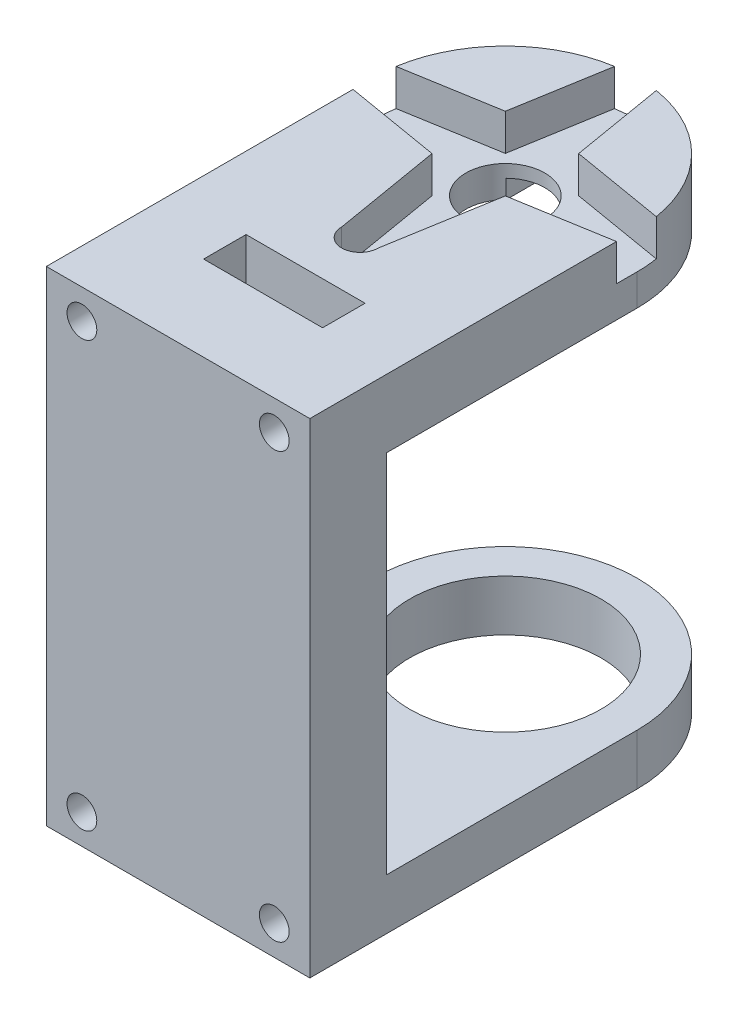
ISO-10303-21;
HEADER;
FILE_DESCRIPTION(('STEP AP214'),'2;1');
FILE_NAME('part.step','',(''),(''),'','','');
FILE_SCHEMA(('AUTOMOTIVE_DESIGN { 1 0 10303 214 1 1 1 1 }'));
ENDSEC;
DATA;
#1=APPLICATION_CONTEXT('core data for automotive mechanical design processes');
#2=APPLICATION_PROTOCOL_DEFINITION('international standard','automotive_design',2000,#1);
#3=PRODUCT_CONTEXT('',#1,'mechanical');
#4=PRODUCT('Part','Part','',(#3));
#5=PRODUCT_RELATED_PRODUCT_CATEGORY('part','',(#4));
#6=PRODUCT_DEFINITION_FORMATION('','',#4);
#7=PRODUCT_DEFINITION_CONTEXT('part definition',#1,'design');
#8=PRODUCT_DEFINITION('design','',#6,#7);
#9=PRODUCT_DEFINITION_SHAPE('','',#8);
#10=(LENGTH_UNIT() NAMED_UNIT(*) SI_UNIT(.MILLI.,.METRE.));
#11=(NAMED_UNIT(*) PLANE_ANGLE_UNIT() SI_UNIT($,.RADIAN.));
#12=(NAMED_UNIT(*) SI_UNIT($,.STERADIAN.) SOLID_ANGLE_UNIT());
#13=UNCERTAINTY_MEASURE_WITH_UNIT(LENGTH_MEASURE(1.E-05),#10,'distance_accuracy_value','');
#14=(GEOMETRIC_REPRESENTATION_CONTEXT(3) GLOBAL_UNCERTAINTY_ASSIGNED_CONTEXT((#13)) GLOBAL_UNIT_ASSIGNED_CONTEXT((#10,
#11,#12)) REPRESENTATION_CONTEXT('',''));
#15=CARTESIAN_POINT('',(0.,0.,0.));
#16=DIRECTION('',(0.,0.,1.));
#17=DIRECTION('',(1.,0.,0.));
#18=AXIS2_PLACEMENT_3D('',#15,#16,#17);
#19=CARTESIAN_POINT('',(15.5,20.5,-45.));
#20=DIRECTION('',(0.,1.,0.));
#21=DIRECTION('',(0.,0.,1.));
#22=AXIS2_PLACEMENT_3D('',#19,#20,#21);
#23=PLANE('',#22);
#24=DIRECTION('',(-1.,0.,0.));
#25=VECTOR('',#24,1.);
#26=CARTESIAN_POINT('',(15.5,20.5,-6.00000000000001));
#27=LINE('',#26,#25);
#28=CARTESIAN_POINT('',(7.,20.5,-6.));
#29=VERTEX_POINT('',#28);
#30=CARTESIAN_POINT('',(-7.,20.5,-6.));
#31=VERTEX_POINT('',#30);
#32=EDGE_CURVE('E266',#29,#31,#27,.T.);
#33=ORIENTED_EDGE('',*,*,#32,.T.);
#34=DIRECTION('',(0.,0.,1.));
#35=VECTOR('',#34,1.);
#36=CARTESIAN_POINT('',(-6.99999999999999,20.5,-45.));
#37=LINE('',#36,#35);
#38=CARTESIAN_POINT('',(-7.,20.5,-1.));
#39=VERTEX_POINT('',#38);
#40=EDGE_CURVE('E269',#31,#39,#37,.T.);
#41=ORIENTED_EDGE('',*,*,#40,.T.);
#42=DIRECTION('',(1.,0.,0.));
#43=VECTOR('',#42,1.);
#44=CARTESIAN_POINT('',(15.5,20.5,-1.));
#45=LINE('',#44,#43);
#46=CARTESIAN_POINT('',(7.,20.5,-1.));
#47=VERTEX_POINT('',#46);
#48=EDGE_CURVE('E261',#39,#47,#45,.T.);
#49=ORIENTED_EDGE('',*,*,#48,.T.);
#50=DIRECTION('',(0.,0.,-1.));
#51=VECTOR('',#50,1.);
#52=CARTESIAN_POINT('',(7.,20.5,-45.));
#53=LINE('',#52,#51);
#54=EDGE_CURVE('E241',#47,#29,#53,.T.);
#55=ORIENTED_EDGE('',*,*,#54,.T.);
#56=EDGE_LOOP('',(#33,#41,#49,#55));
#57=FACE_BOUND('',#56,.T.);
#58=DIRECTION('',(0.,0.,-1.));
#59=VECTOR('',#58,1.);
#60=CARTESIAN_POINT('',(-3.25,20.5,0.));
#61=LINE('',#60,#59);
#62=CARTESIAN_POINT('',(-3.25,20.5,-32.8256578296632));
#63=VERTEX_POINT('',#62);
#64=CARTESIAN_POINT('',(-3.25,20.5,-44.6554445662277));
#65=VERTEX_POINT('',#64);
#66=EDGE_CURVE('E277',#63,#65,#61,.T.);
#67=ORIENTED_EDGE('',*,*,#66,.F.);
#68=CARTESIAN_POINT('',(0.,20.5,-29.5));
#69=DIRECTION('',(0.,-1.,0.));
#70=DIRECTION('',(0.,0.,-1.));
#71=AXIS2_PLACEMENT_3D('',#68,#69,#70);
#72=CIRCLE('',#71,4.65);
#73=CARTESIAN_POINT('',(3.25,20.5,-32.8256578296632));
#74=VERTEX_POINT('',#73);
#75=EDGE_CURVE('E272',#74,#63,#72,.T.);
#76=ORIENTED_EDGE('',*,*,#75,.F.);
#77=DIRECTION('',(0.,0.,-1.));
#78=VECTOR('',#77,1.);
#79=CARTESIAN_POINT('',(3.24999999999999,20.5,0.));
#80=LINE('',#79,#78);
#81=CARTESIAN_POINT('',(3.25000000000001,20.5,-44.6554445662277));
#82=VERTEX_POINT('',#81);
#83=EDGE_CURVE('E281',#74,#82,#80,.T.);
#84=ORIENTED_EDGE('',*,*,#83,.T.);
#85=CARTESIAN_POINT('',(0.,20.5,-29.5));
#86=DIRECTION('',(0.,1.,0.));
#87=DIRECTION('',(0.,0.,1.));
#88=AXIS2_PLACEMENT_3D('',#85,#86,#87);
#89=CIRCLE('',#88,15.5);
#90=CARTESIAN_POINT('',(15.5,20.5,-29.5));
#91=VERTEX_POINT('',#90);
#92=EDGE_CURVE('E385',#82,#91,#89,.F.);
#93=ORIENTED_EDGE('',*,*,#92,.T.);
#94=DIRECTION('',(0.,0.,1.));
#95=VECTOR('',#94,1.);
#96=CARTESIAN_POINT('',(15.5,20.5,-45.));
#97=LINE('',#96,#95);
#98=CARTESIAN_POINT('',(15.5,20.5,0.));
#99=VERTEX_POINT('',#98);
#100=EDGE_CURVE('E401',#91,#99,#97,.T.);
#101=ORIENTED_EDGE('',*,*,#100,.T.);
#102=DIRECTION('',(-1.,0.,0.));
#103=VECTOR('',#102,1.);
#104=CARTESIAN_POINT('',(15.5,20.5,0.));
#105=LINE('',#104,#103);
#106=CARTESIAN_POINT('',(-15.5,20.5,0.));
#107=VERTEX_POINT('',#106);
#108=EDGE_CURVE('E396',#99,#107,#105,.T.);
#109=ORIENTED_EDGE('',*,*,#108,.T.);
#110=DIRECTION('',(0.,0.,1.));
#111=VECTOR('',#110,1.);
#112=CARTESIAN_POINT('',(-15.5,20.5,-45.));
#113=LINE('',#112,#111);
#114=CARTESIAN_POINT('',(-15.5,20.5,-29.5));
#115=VERTEX_POINT('',#114);
#116=EDGE_CURVE('E399',#115,#107,#113,.T.);
#117=ORIENTED_EDGE('',*,*,#116,.F.);
#118=EDGE_CURVE('E386',#115,#65,#89,.F.);
#119=ORIENTED_EDGE('',*,*,#118,.T.);
#120=EDGE_LOOP('',(#67,#76,#84,#93,#101,#109,#117,#119));
#121=FACE_BOUND('',#120,.T.);
#122=ADVANCED_FACE('F50',(#57,#121),#23,.F.);
#123=CARTESIAN_POINT('',(0.,28.5,-29.5));
#124=DIRECTION('',(0.,-1.,0.));
#125=DIRECTION('',(0.,0.,-1.));
#126=AXIS2_PLACEMENT_3D('',#123,#124,#125);
#127=CYLINDRICAL_SURFACE('',#126,15.5);
#128=DIRECTION('',(0.,-1.,0.));
#129=VECTOR('',#128,1.);
#130=CARTESIAN_POINT('',(3.25000000000001,22.7,-44.6554445662277));
#131=LINE('',#130,#129);
#132=CARTESIAN_POINT('',(3.25000000000001,22.7,-44.6554445662277));
#133=VERTEX_POINT('',#132);
#134=EDGE_CURVE('E295',#133,#82,#131,.T.);
#135=ORIENTED_EDGE('',*,*,#134,.F.);
#136=CARTESIAN_POINT('',(0.,22.7,-29.5));
#137=DIRECTION('',(0.,-1.,0.));
#138=DIRECTION('',(0.,0.,-1.));
#139=AXIS2_PLACEMENT_3D('',#136,#137,#138);
#140=CIRCLE('',#139,15.5);
#141=CARTESIAN_POINT('',(-3.25,22.7,-44.6554445662277));
#142=VERTEX_POINT('',#141);
#143=EDGE_CURVE('E283',#142,#133,#140,.T.);
#144=ORIENTED_EDGE('',*,*,#143,.F.);
#145=DIRECTION('',(0.,-1.,0.));
#146=VECTOR('',#145,1.);
#147=CARTESIAN_POINT('',(-3.25,22.7,-44.6554445662277));
#148=LINE('',#147,#146);
#149=EDGE_CURVE('E297',#142,#65,#148,.T.);
#150=ORIENTED_EDGE('',*,*,#149,.T.);
#151=ORIENTED_EDGE('',*,*,#118,.F.);
#152=DIRECTION('',(0.,-1.,0.));
#153=VECTOR('',#152,1.);
#154=CARTESIAN_POINT('',(-15.5,28.5,-29.5));
#155=LINE('',#154,#153);
#156=CARTESIAN_POINT('',(-15.5,24.2,-29.5));
#157=VERTEX_POINT('',#156);
#158=EDGE_CURVE('E371',#157,#115,#155,.T.);
#159=ORIENTED_EDGE('',*,*,#158,.F.);
#160=CARTESIAN_POINT('',(0.,24.2,-29.5));
#161=DIRECTION('',(0.,1.,0.));
#162=DIRECTION('',(0.,0.,1.));
#163=AXIS2_PLACEMENT_3D('',#160,#161,#162);
#164=CIRCLE('',#163,15.5);
#165=CARTESIAN_POINT('',(-15.3045421529556,24.2,-31.953770463675));
#166=VERTEX_POINT('',#165);
#167=EDGE_CURVE('E429',#166,#157,#164,.T.);
#168=ORIENTED_EDGE('',*,*,#167,.F.);
#169=DIRECTION('',(0.,-1.,0.));
#170=VECTOR('',#169,1.);
#171=CARTESIAN_POINT('',(-15.3045421529556,28.5,-31.953770463675));
#172=LINE('',#171,#170);
#173=CARTESIAN_POINT('',(-15.3045421529556,28.5,-31.953770463675));
#174=VERTEX_POINT('',#173);
#175=EDGE_CURVE('E431',#166,#174,#172,.F.);
#176=ORIENTED_EDGE('',*,*,#175,.T.);
#177=CARTESIAN_POINT('',(0.,28.5,-29.5));
#178=DIRECTION('',(0.,-1.,0.));
#179=DIRECTION('',(0.,0.,-1.));
#180=AXIS2_PLACEMENT_3D('',#177,#178,#179);
#181=CIRCLE('',#180,15.5);
#182=CARTESIAN_POINT('',(-2.45377046367497,28.5,-44.8045421529556));
#183=VERTEX_POINT('',#182);
#184=EDGE_CURVE('E374',#183,#174,#181,.F.);
#185=ORIENTED_EDGE('',*,*,#184,.F.);
#186=DIRECTION('',(0.,-1.,0.));
#187=VECTOR('',#186,1.);
#188=CARTESIAN_POINT('',(-2.45377046367497,28.5,-44.8045421529556));
#189=LINE('',#188,#187);
#190=CARTESIAN_POINT('',(-2.45377046367497,24.2,-44.8045421529556));
#191=VERTEX_POINT('',#190);
#192=EDGE_CURVE('E439',#183,#191,#189,.T.);
#193=ORIENTED_EDGE('',*,*,#192,.T.);
#194=CARTESIAN_POINT('',(2.45377046367497,24.2,-44.8045421529556));
#195=VERTEX_POINT('',#194);
#196=EDGE_CURVE('E433',#195,#191,#164,.T.);
#197=ORIENTED_EDGE('',*,*,#196,.F.);
#198=DIRECTION('',(0.,-1.,0.));
#199=VECTOR('',#198,1.);
#200=CARTESIAN_POINT('',(2.45377046367497,28.5,-44.8045421529556));
#201=LINE('',#200,#199);
#202=CARTESIAN_POINT('',(2.45377046367497,28.5,-44.8045421529556));
#203=VERTEX_POINT('',#202);
#204=EDGE_CURVE('E436',#195,#203,#201,.F.);
#205=ORIENTED_EDGE('',*,*,#204,.T.);
#206=CARTESIAN_POINT('',(15.3045421529557,28.5,-31.953770463675));
#207=VERTEX_POINT('',#206);
#208=EDGE_CURVE('E377',#207,#203,#181,.F.);
#209=ORIENTED_EDGE('',*,*,#208,.F.);
#210=DIRECTION('',(0.,-1.,0.));
#211=VECTOR('',#210,1.);
#212=CARTESIAN_POINT('',(15.3045421529556,28.5,-31.953770463675));
#213=LINE('',#212,#211);
#214=CARTESIAN_POINT('',(15.3045421529557,24.2,-31.953770463675));
#215=VERTEX_POINT('',#214);
#216=EDGE_CURVE('E442',#207,#215,#213,.T.);
#217=ORIENTED_EDGE('',*,*,#216,.T.);
#218=CARTESIAN_POINT('',(15.5,24.2,-29.5));
#219=VERTEX_POINT('',#218);
#220=EDGE_CURVE('E432',#219,#215,#164,.T.);
#221=ORIENTED_EDGE('',*,*,#220,.F.);
#222=DIRECTION('',(0.,-1.,0.));
#223=VECTOR('',#222,1.);
#224=CARTESIAN_POINT('',(15.5,28.5,-29.5));
#225=LINE('',#224,#223);
#226=EDGE_CURVE('E379',#219,#91,#225,.T.);
#227=ORIENTED_EDGE('',*,*,#226,.T.);
#228=ORIENTED_EDGE('',*,*,#92,.F.);
#229=EDGE_LOOP('',(#135,#144,#150,#151,#159,#168,#176,#185,#193,#197,#205,#209,#217,#221,#227,#228));
#230=FACE_BOUND('',#229,.T.);
#231=ADVANCED_FACE('F493',(#230),#127,.T.);
#232=CARTESIAN_POINT('',(15.5,28.5,9.));
#233=DIRECTION('',(0.,-1.,0.));
#234=DIRECTION('',(0.,0.,-1.));
#235=AXIS2_PLACEMENT_3D('',#232,#233,#234);
#236=PLANE('',#235);
#237=ORIENTED_EDGE('',*,*,#184,.T.);
#238=DIRECTION('',(-0.985987773459867,0.,0.16681759675662));
#239=VECTOR('',#238,1.);
#240=CARTESIAN_POINT('',(-17.1,28.5,-31.65));
#241=LINE('',#240,#239);
#242=CARTESIAN_POINT('',(-4.31335136523794,28.5,-33.8133513652379));
#243=VERTEX_POINT('',#242);
#244=EDGE_CURVE('E305',#243,#174,#241,.T.);
#245=ORIENTED_EDGE('',*,*,#244,.F.);
#246=DIRECTION('',(-0.16681759675662,0.,0.985987773459867));
#247=VECTOR('',#246,1.);
#248=CARTESIAN_POINT('',(-4.31335136523794,28.5,-33.8133513652379));
#249=LINE('',#248,#247);
#250=EDGE_CURVE('E343',#183,#243,#249,.T.);
#251=ORIENTED_EDGE('',*,*,#250,.F.);
#252=EDGE_LOOP('',(#237,#245,#251));
#253=FACE_BOUND('',#252,.T.);
#254=ADVANCED_FACE('F511',(#253),#236,.F.);
#255=ORIENTED_EDGE('',*,*,#208,.T.);
#256=DIRECTION('',(-0.16681759675662,0.,-0.985987773459867));
#257=VECTOR('',#256,1.);
#258=CARTESIAN_POINT('',(4.31335136523794,28.5,-33.8133513652379));
#259=LINE('',#258,#257);
#260=CARTESIAN_POINT('',(4.31335136523794,28.5,-33.8133513652379));
#261=VERTEX_POINT('',#260);
#262=EDGE_CURVE('E341',#261,#203,#259,.T.);
#263=ORIENTED_EDGE('',*,*,#262,.F.);
#264=DIRECTION('',(-0.985987773459867,0.,-0.16681759675662));
#265=VECTOR('',#264,1.);
#266=CARTESIAN_POINT('',(17.1,28.5,-31.65));
#267=LINE('',#266,#265);
#268=EDGE_CURVE('E339',#207,#261,#267,.T.);
#269=ORIENTED_EDGE('',*,*,#268,.F.);
#270=EDGE_LOOP('',(#255,#263,#269));
#271=FACE_BOUND('',#270,.T.);
#272=ADVANCED_FACE('F560',(#271),#236,.F.);
#273=CARTESIAN_POINT('',(15.5,-28.5,9.));
#274=DIRECTION('',(0.,1.,0.));
#275=DIRECTION('',(0.,0.,1.));
#276=AXIS2_PLACEMENT_3D('',#273,#274,#275);
#277=PLANE('',#276);
#278=CARTESIAN_POINT('',(0.,-28.5,-29.5));
#279=DIRECTION('',(0.,-1.,0.));
#280=DIRECTION('',(0.,0.,-1.));
#281=AXIS2_PLACEMENT_3D('',#278,#279,#280);
#282=CIRCLE('',#281,11.25);
#283=CARTESIAN_POINT('',(0.,-28.5,-40.75));
#284=VERTEX_POINT('',#283);
#285=EDGE_CURVE('E364',#284,#284,#282,.T.);
#286=ORIENTED_EDGE('',*,*,#285,.F.);
#287=EDGE_LOOP('',(#286));
#288=FACE_BOUND('',#287,.T.);
#289=DIRECTION('',(0.,0.,-1.));
#290=VECTOR('',#289,1.);
#291=CARTESIAN_POINT('',(-15.5,-28.5,9.));
#292=LINE('',#291,#290);
#293=CARTESIAN_POINT('',(-15.5,-28.5,9.));
#294=VERTEX_POINT('',#293);
#295=CARTESIAN_POINT('',(-15.5,-28.5,-29.5));
#296=VERTEX_POINT('',#295);
#297=EDGE_CURVE('E426',#294,#296,#292,.T.);
#298=ORIENTED_EDGE('',*,*,#297,.T.);
#299=CARTESIAN_POINT('',(0.,-28.5,-29.5));
#300=DIRECTION('',(0.,-1.,0.));
#301=DIRECTION('',(0.,0.,-1.));
#302=AXIS2_PLACEMENT_3D('',#299,#300,#301);
#303=CIRCLE('',#302,15.5);
#304=CARTESIAN_POINT('',(15.5,-28.5,-29.5));
#305=VERTEX_POINT('',#304);
#306=EDGE_CURVE('E373',#305,#296,#303,.F.);
#307=ORIENTED_EDGE('',*,*,#306,.F.);
#308=DIRECTION('',(0.,0.,-1.));
#309=VECTOR('',#308,1.);
#310=CARTESIAN_POINT('',(15.5,-28.5,9.));
#311=LINE('',#310,#309);
#312=CARTESIAN_POINT('',(15.5,-28.5,9.));
#313=VERTEX_POINT('',#312);
#314=EDGE_CURVE('E423',#313,#305,#311,.T.);
#315=ORIENTED_EDGE('',*,*,#314,.F.);
#316=DIRECTION('',(1.,0.,0.));
#317=VECTOR('',#316,1.);
#318=CARTESIAN_POINT('',(15.5,-28.5,9.));
#319=LINE('',#318,#317);
#320=EDGE_CURVE('E406',#294,#313,#319,.T.);
#321=ORIENTED_EDGE('',*,*,#320,.F.);
#322=EDGE_LOOP('',(#298,#307,#315,#321));
#323=FACE_BOUND('',#322,.T.);
#324=ADVANCED_FACE('F468',(#288,#323),#277,.F.);
#325=DIRECTION('',(1.,0.,0.));
#326=VECTOR('',#325,1.);
#327=CARTESIAN_POINT('',(7.,28.5,-1.));
#328=LINE('',#327,#326);
#329=CARTESIAN_POINT('',(-7.,28.5,-1.));
#330=VERTEX_POINT('',#329);
#331=CARTESIAN_POINT('',(7.,28.5,-1.));
#332=VERTEX_POINT('',#331);
#333=EDGE_CURVE('E247',#330,#332,#328,.T.);
#334=ORIENTED_EDGE('',*,*,#333,.F.);
#335=DIRECTION('',(0.,0.,1.));
#336=VECTOR('',#335,1.);
#337=CARTESIAN_POINT('',(-7.,28.5,-1.));
#338=LINE('',#337,#336);
#339=CARTESIAN_POINT('',(-7.,28.5,-6.));
#340=VERTEX_POINT('',#339);
#341=EDGE_CURVE('E73',#340,#330,#338,.T.);
#342=ORIENTED_EDGE('',*,*,#341,.F.);
#343=DIRECTION('',(-1.,0.,0.));
#344=VECTOR('',#343,1.);
#345=CARTESIAN_POINT('',(7.,28.5,-6.));
#346=LINE('',#345,#344);
#347=CARTESIAN_POINT('',(7.,28.5,-6.));
#348=VERTEX_POINT('',#347);
#349=EDGE_CURVE('E254',#348,#340,#346,.T.);
#350=ORIENTED_EDGE('',*,*,#349,.F.);
#351=DIRECTION('',(0.,0.,-1.));
#352=VECTOR('',#351,1.);
#353=CARTESIAN_POINT('',(7.,28.5,-1.));
#354=LINE('',#353,#352);
#355=EDGE_CURVE('E238',#332,#348,#354,.T.);
#356=ORIENTED_EDGE('',*,*,#355,.F.);
#357=EDGE_LOOP('',(#334,#342,#350,#356));
#358=FACE_BOUND('',#357,.T.);
#359=DIRECTION('',(0.,0.,-1.));
#360=VECTOR('',#359,1.);
#361=CARTESIAN_POINT('',(15.5,28.5,9.));
#362=LINE('',#361,#360);
#363=CARTESIAN_POINT('',(15.5,28.5,9.));
#364=VERTEX_POINT('',#363);
#365=CARTESIAN_POINT('',(15.5,28.5,-27.0792987174942));
#366=VERTEX_POINT('',#365);
#367=EDGE_CURVE('E420',#364,#366,#362,.T.);
#368=ORIENTED_EDGE('',*,*,#367,.T.);
#369=DIRECTION('',(0.985987773459867,0.,-0.166817596756619));
#370=VECTOR('',#369,1.);
#371=CARTESIAN_POINT('',(17.1,28.5,-27.35));
#372=LINE('',#371,#370);
#373=CARTESIAN_POINT('',(4.31335136523794,28.5,-25.1866486347621));
#374=VERTEX_POINT('',#373);
#375=EDGE_CURVE('E337',#374,#366,#372,.T.);
#376=ORIENTED_EDGE('',*,*,#375,.F.);
#377=DIRECTION('',(0.16681759675662,0.,-0.985987773459867));
#378=VECTOR('',#377,1.);
#379=CARTESIAN_POINT('',(4.31335136523794,28.5,-25.1866486347621));
#380=LINE('',#379,#378);
#381=CARTESIAN_POINT('',(2.14999999999999,28.5,-12.4));
#382=VERTEX_POINT('',#381);
#383=EDGE_CURVE('E334',#382,#374,#380,.T.);
#384=ORIENTED_EDGE('',*,*,#383,.F.);
#385=CARTESIAN_POINT('',(0.,28.5,-12.4));
#386=DIRECTION('',(0.,1.,0.));
#387=DIRECTION('',(0.,0.,1.));
#388=AXIS2_PLACEMENT_3D('',#385,#386,#387);
#389=CIRCLE('',#388,2.14999999999999);
#390=CARTESIAN_POINT('',(-2.14999999999998,28.5,-12.4));
#391=VERTEX_POINT('',#390);
#392=EDGE_CURVE('E331',#391,#382,#389,.T.);
#393=ORIENTED_EDGE('',*,*,#392,.F.);
#394=DIRECTION('',(0.16681759675662,0.,0.985987773459867));
#395=VECTOR('',#394,1.);
#396=CARTESIAN_POINT('',(-4.31335136523794,28.5,-25.1866486347621));
#397=LINE('',#396,#395);
#398=CARTESIAN_POINT('',(-4.31335136523794,28.5,-25.1866486347621));
#399=VERTEX_POINT('',#398);
#400=EDGE_CURVE('E328',#399,#391,#397,.T.);
#401=ORIENTED_EDGE('',*,*,#400,.F.);
#402=DIRECTION('',(0.985987773459867,0.,0.166817596756619));
#403=VECTOR('',#402,1.);
#404=CARTESIAN_POINT('',(-17.1,28.5,-27.35));
#405=LINE('',#404,#403);
#406=CARTESIAN_POINT('',(-15.5,28.5,-27.0792987174942));
#407=VERTEX_POINT('',#406);
#408=EDGE_CURVE('E294',#407,#399,#405,.T.);
#409=ORIENTED_EDGE('',*,*,#408,.F.);
#410=DIRECTION('',(0.,0.,-1.));
#411=VECTOR('',#410,1.);
#412=CARTESIAN_POINT('',(-15.5,28.5,9.));
#413=LINE('',#412,#411);
#414=CARTESIAN_POINT('',(-15.5,28.5,9.));
#415=VERTEX_POINT('',#414);
#416=EDGE_CURVE('E413',#415,#407,#413,.T.);
#417=ORIENTED_EDGE('',*,*,#416,.F.);
#418=DIRECTION('',(-1.,0.,0.));
#419=VECTOR('',#418,1.);
#420=CARTESIAN_POINT('',(15.5,28.5,9.));
#421=LINE('',#420,#419);
#422=EDGE_CURVE('E411',#364,#415,#421,.T.);
#423=ORIENTED_EDGE('',*,*,#422,.F.);
#424=EDGE_LOOP('',(#368,#376,#384,#393,#401,#409,#417,#423));
#425=FACE_BOUND('',#424,.T.);
#426=ADVANCED_FACE('F251',(#358,#425),#236,.F.);
#427=CARTESIAN_POINT('',(15.5,-22.5,-45.));
#428=DIRECTION('',(0.,-1.,0.));
#429=DIRECTION('',(0.,0.,-1.));
#430=AXIS2_PLACEMENT_3D('',#427,#428,#429);
#431=PLANE('',#430);
#432=CARTESIAN_POINT('',(0.,-22.5,-29.5));
#433=DIRECTION('',(0.,-1.,0.));
#434=DIRECTION('',(0.,0.,-1.));
#435=AXIS2_PLACEMENT_3D('',#432,#433,#434);
#436=CIRCLE('',#435,11.25);
#437=CARTESIAN_POINT('',(0.,-22.5,-40.75));
#438=VERTEX_POINT('',#437);
#439=EDGE_CURVE('E365',#438,#438,#436,.T.);
#440=ORIENTED_EDGE('',*,*,#439,.T.);
#441=EDGE_LOOP('',(#440));
#442=FACE_BOUND('',#441,.T.);
#443=CARTESIAN_POINT('',(0.,-22.5,-29.5));
#444=DIRECTION('',(0.,-1.,0.));
#445=DIRECTION('',(0.,0.,-1.));
#446=AXIS2_PLACEMENT_3D('',#443,#444,#445);
#447=CIRCLE('',#446,15.5);
#448=CARTESIAN_POINT('',(15.5,-22.5,-29.5));
#449=VERTEX_POINT('',#448);
#450=CARTESIAN_POINT('',(-15.5,-22.5,-29.5));
#451=VERTEX_POINT('',#450);
#452=EDGE_CURVE('E382',#449,#451,#447,.F.);
#453=ORIENTED_EDGE('',*,*,#452,.T.);
#454=DIRECTION('',(0.,0.,1.));
#455=VECTOR('',#454,1.);
#456=CARTESIAN_POINT('',(-15.5,-22.5,-45.));
#457=LINE('',#456,#455);
#458=CARTESIAN_POINT('',(-15.5,-22.5,0.));
#459=VERTEX_POINT('',#458);
#460=EDGE_CURVE('E394',#451,#459,#457,.T.);
#461=ORIENTED_EDGE('',*,*,#460,.T.);
#462=DIRECTION('',(1.,0.,0.));
#463=VECTOR('',#462,1.);
#464=CARTESIAN_POINT('',(15.5,-22.5,0.));
#465=LINE('',#464,#463);
#466=CARTESIAN_POINT('',(15.5,-22.5,0.));
#467=VERTEX_POINT('',#466);
#468=EDGE_CURVE('E389',#459,#467,#465,.T.);
#469=ORIENTED_EDGE('',*,*,#468,.T.);
#470=DIRECTION('',(0.,0.,1.));
#471=VECTOR('',#470,1.);
#472=CARTESIAN_POINT('',(15.5,-22.5,-45.));
#473=LINE('',#472,#471);
#474=EDGE_CURVE('E392',#449,#467,#473,.T.);
#475=ORIENTED_EDGE('',*,*,#474,.F.);
#476=EDGE_LOOP('',(#453,#461,#469,#475));
#477=FACE_BOUND('',#476,.T.);
#478=ADVANCED_FACE('F478',(#442,#477),#431,.F.);
#479=CARTESIAN_POINT('',(-15.5,-28.5,9.));
#480=DIRECTION('',(1.,0.,0.));
#481=DIRECTION('',(0.,0.,-1.));
#482=AXIS2_PLACEMENT_3D('',#479,#480,#481);
#483=PLANE('',#482);
#484=ORIENTED_EDGE('',*,*,#416,.T.);
#485=DIRECTION('',(0.,-1.,0.));
#486=VECTOR('',#485,1.);
#487=CARTESIAN_POINT('',(-15.5,-28.5,-27.0792987174942));
#488=LINE('',#487,#486);
#489=CARTESIAN_POINT('',(-15.5,24.2,-27.0792987174942));
#490=VERTEX_POINT('',#489);
#491=EDGE_CURVE('E12',#407,#490,#488,.T.);
#492=ORIENTED_EDGE('',*,*,#491,.T.);
#493=DIRECTION('',(0.,0.,1.));
#494=VECTOR('',#493,1.);
#495=CARTESIAN_POINT('',(-15.5,24.2,9.));
#496=LINE('',#495,#494);
#497=EDGE_CURVE('E349',#157,#490,#496,.T.);
#498=ORIENTED_EDGE('',*,*,#497,.F.);
#499=ORIENTED_EDGE('',*,*,#158,.T.);
#500=ORIENTED_EDGE('',*,*,#116,.T.);
#501=DIRECTION('',(0.,-1.,0.));
#502=VECTOR('',#501,1.);
#503=CARTESIAN_POINT('',(-15.5,-28.5,0.));
#504=LINE('',#503,#502);
#505=EDGE_CURVE('E403',#107,#459,#504,.T.);
#506=ORIENTED_EDGE('',*,*,#505,.T.);
#507=ORIENTED_EDGE('',*,*,#460,.F.);
#508=EDGE_CURVE('E368',#451,#296,#155,.T.);
#509=ORIENTED_EDGE('',*,*,#508,.T.);
#510=ORIENTED_EDGE('',*,*,#297,.F.);
#511=DIRECTION('',(0.,-1.,0.));
#512=VECTOR('',#511,1.);
#513=CARTESIAN_POINT('',(-15.5,10.3,9.));
#514=LINE('',#513,#512);
#515=EDGE_CURVE('E404',#415,#294,#514,.T.);
#516=ORIENTED_EDGE('',*,*,#515,.F.);
#517=EDGE_LOOP('',(#484,#492,#498,#499,#500,#506,#507,#509,#510,#516));
#518=FACE_BOUND('',#517,.T.);
#519=ADVANCED_FACE('F52',(#518),#483,.F.);
#520=CARTESIAN_POINT('',(0.,0.,0.));
#521=DIRECTION('',(0.,0.,1.));
#522=DIRECTION('',(1.,0.,0.));
#523=AXIS2_PLACEMENT_3D('',#520,#521,#522);
#524=PLANE('',#523);
#525=ORIENTED_EDGE('',*,*,#468,.F.);
#526=ORIENTED_EDGE('',*,*,#505,.F.);
#527=ORIENTED_EDGE('',*,*,#108,.F.);
#528=DIRECTION('',(0.,1.,0.));
#529=VECTOR('',#528,1.);
#530=CARTESIAN_POINT('',(15.5,-28.5,0.));
#531=LINE('',#530,#529);
#532=EDGE_CURVE('E407',#467,#99,#531,.T.);
#533=ORIENTED_EDGE('',*,*,#532,.F.);
#534=EDGE_LOOP('',(#525,#526,#527,#533));
#535=FACE_BOUND('',#534,.T.);
#536=ADVANCED_FACE('F481',(#535),#524,.F.);
#537=CARTESIAN_POINT('',(15.5,-28.5,9.));
#538=DIRECTION('',(-1.,0.,0.));
#539=DIRECTION('',(0.,0.,1.));
#540=AXIS2_PLACEMENT_3D('',#537,#538,#539);
#541=PLANE('',#540);
#542=DIRECTION('',(0.,0.,-1.));
#543=VECTOR('',#542,1.);
#544=CARTESIAN_POINT('',(15.5,24.2,9.));
#545=LINE('',#544,#543);
#546=CARTESIAN_POINT('',(15.5,24.2,-27.0792987174942));
#547=VERTEX_POINT('',#546);
#548=EDGE_CURVE('E362',#547,#219,#545,.T.);
#549=ORIENTED_EDGE('',*,*,#548,.F.);
#550=DIRECTION('',(0.,1.,0.));
#551=VECTOR('',#550,1.);
#552=CARTESIAN_POINT('',(15.5,-28.5,-27.0792987174942));
#553=LINE('',#552,#551);
#554=EDGE_CURVE('E58',#547,#366,#553,.T.);
#555=ORIENTED_EDGE('',*,*,#554,.T.);
#556=ORIENTED_EDGE('',*,*,#367,.F.);
#557=DIRECTION('',(0.,1.,0.));
#558=VECTOR('',#557,1.);
#559=CARTESIAN_POINT('',(15.5,-28.5,9.));
#560=LINE('',#559,#558);
#561=EDGE_CURVE('E409',#313,#364,#560,.T.);
#562=ORIENTED_EDGE('',*,*,#561,.F.);
#563=ORIENTED_EDGE('',*,*,#314,.T.);
#564=EDGE_CURVE('E383',#449,#305,#225,.T.);
#565=ORIENTED_EDGE('',*,*,#564,.F.);
#566=ORIENTED_EDGE('',*,*,#474,.T.);
#567=ORIENTED_EDGE('',*,*,#532,.T.);
#568=ORIENTED_EDGE('',*,*,#100,.F.);
#569=ORIENTED_EDGE('',*,*,#226,.F.);
#570=EDGE_LOOP('',(#549,#555,#556,#562,#563,#565,#566,#567,#568,#569));
#571=FACE_BOUND('',#570,.T.);
#572=ADVANCED_FACE('F448',(#571),#541,.F.);
#573=CARTESIAN_POINT('',(0.,0.,9.));
#574=DIRECTION('',(0.,0.,1.));
#575=DIRECTION('',(1.,0.,0.));
#576=AXIS2_PLACEMENT_3D('',#573,#574,#575);
#577=PLANE('',#576);
#578=CARTESIAN_POINT('',(-11.3164293901511,25.,9.));
#579=DIRECTION('',(0.,0.,1.));
#580=DIRECTION('',(-1.,0.,0.));
#581=AXIS2_PLACEMENT_3D('',#578,#579,#580);
#582=CIRCLE('',#581,1.75);
#583=CARTESIAN_POINT('',(-13.0664293901511,25.,9.));
#584=VERTEX_POINT('',#583);
#585=EDGE_CURVE('E665',#584,#584,#582,.T.);
#586=ORIENTED_EDGE('',*,*,#585,.F.);
#587=EDGE_LOOP('',(#586));
#588=FACE_BOUND('',#587,.T.);
#589=CARTESIAN_POINT('',(11.3164293901511,-25.,9.));
#590=DIRECTION('',(0.,0.,1.));
#591=DIRECTION('',(-1.,0.,0.));
#592=AXIS2_PLACEMENT_3D('',#589,#590,#591);
#593=CIRCLE('',#592,1.75);
#594=CARTESIAN_POINT('',(9.56642939015113,-25.,9.));
#595=VERTEX_POINT('',#594);
#596=EDGE_CURVE('E676',#595,#595,#593,.T.);
#597=ORIENTED_EDGE('',*,*,#596,.F.);
#598=EDGE_LOOP('',(#597));
#599=FACE_BOUND('',#598,.T.);
#600=CARTESIAN_POINT('',(-11.3164293901512,-25.,9.));
#601=DIRECTION('',(0.,0.,1.));
#602=DIRECTION('',(1.,0.,0.));
#603=AXIS2_PLACEMENT_3D('',#600,#601,#602);
#604=CIRCLE('',#603,1.75);
#605=CARTESIAN_POINT('',(-9.56642939015117,-25.,9.));
#606=VERTEX_POINT('',#605);
#607=EDGE_CURVE('E682',#606,#606,#604,.T.);
#608=ORIENTED_EDGE('',*,*,#607,.F.);
#609=EDGE_LOOP('',(#608));
#610=FACE_BOUND('',#609,.T.);
#611=CARTESIAN_POINT('',(11.3164293901511,25.,9.));
#612=DIRECTION('',(0.,0.,1.));
#613=DIRECTION('',(1.,0.,0.));
#614=AXIS2_PLACEMENT_3D('',#611,#612,#613);
#615=CIRCLE('',#614,1.75);
#616=CARTESIAN_POINT('',(13.0664293901511,25.,9.));
#617=VERTEX_POINT('',#616);
#618=EDGE_CURVE('E664',#617,#617,#615,.T.);
#619=ORIENTED_EDGE('',*,*,#618,.F.);
#620=EDGE_LOOP('',(#619));
#621=FACE_BOUND('',#620,.T.);
#622=ORIENTED_EDGE('',*,*,#515,.T.);
#623=ORIENTED_EDGE('',*,*,#320,.T.);
#624=ORIENTED_EDGE('',*,*,#561,.T.);
#625=ORIENTED_EDGE('',*,*,#422,.T.);
#626=EDGE_LOOP('',(#622,#623,#624,#625));
#627=FACE_BOUND('',#626,.T.);
#628=ADVANCED_FACE('F460',(#588,#599,#610,#621,#627),#577,.T.);
#629=ORIENTED_EDGE('',*,*,#564,.T.);
#630=ORIENTED_EDGE('',*,*,#306,.T.);
#631=ORIENTED_EDGE('',*,*,#508,.F.);
#632=ORIENTED_EDGE('',*,*,#452,.F.);
#633=EDGE_LOOP('',(#629,#630,#631,#632));
#634=FACE_BOUND('',#633,.T.);
#635=ADVANCED_FACE('F472',(#634),#127,.T.);
#636=CARTESIAN_POINT('',(0.,-22.5,-29.5));
#637=DIRECTION('',(0.,-1.,0.));
#638=DIRECTION('',(0.,0.,-1.));
#639=AXIS2_PLACEMENT_3D('',#636,#637,#638);
#640=CYLINDRICAL_SURFACE('',#639,11.25);
#641=ORIENTED_EDGE('',*,*,#439,.F.);
#642=EDGE_LOOP('',(#641));
#643=FACE_BOUND('',#642,.T.);
#644=ORIENTED_EDGE('',*,*,#285,.T.);
#645=EDGE_LOOP('',(#644));
#646=FACE_BOUND('',#645,.T.);
#647=ADVANCED_FACE('F570',(#643,#646),#640,.F.);
#648=CARTESIAN_POINT('',(-17.1,24.2,-27.35));
#649=DIRECTION('',(-0.166817596756619,0.,0.985987773459867));
#650=DIRECTION('',(0.985987773459867,0.,0.166817596756619));
#651=AXIS2_PLACEMENT_3D('',#648,#649,#650);
#652=PLANE('',#651);
#653=ORIENTED_EDGE('',*,*,#408,.T.);
#654=DIRECTION('',(0.,1.,0.));
#655=VECTOR('',#654,1.);
#656=CARTESIAN_POINT('',(-4.31335136523794,24.2,-25.1866486347621));
#657=LINE('',#656,#655);
#658=CARTESIAN_POINT('',(-4.31335136523794,24.2,-25.1866486347621));
#659=VERTEX_POINT('',#658);
#660=EDGE_CURVE('E326',#659,#399,#657,.T.);
#661=ORIENTED_EDGE('',*,*,#660,.F.);
#662=DIRECTION('',(0.985987773459867,0.,0.166817596756619));
#663=VECTOR('',#662,1.);
#664=CARTESIAN_POINT('',(-17.1,24.2,-27.35));
#665=LINE('',#664,#663);
#666=EDGE_CURVE('E302',#490,#659,#665,.T.);
#667=ORIENTED_EDGE('',*,*,#666,.F.);
#668=ORIENTED_EDGE('',*,*,#491,.F.);
#669=EDGE_LOOP('',(#653,#661,#667,#668));
#670=FACE_BOUND('',#669,.T.);
#671=ADVANCED_FACE('F572',(#670),#652,.F.);
#672=CARTESIAN_POINT('',(17.1,24.2,-27.35));
#673=DIRECTION('',(0.166817596756619,0.,0.985987773459867));
#674=DIRECTION('',(0.985987773459867,0.,-0.166817596756619));
#675=AXIS2_PLACEMENT_3D('',#672,#673,#674);
#676=PLANE('',#675);
#677=DIRECTION('',(0.985987773459867,0.,-0.166817596756619));
#678=VECTOR('',#677,1.);
#679=CARTESIAN_POINT('',(17.1,24.2,-27.35));
#680=LINE('',#679,#678);
#681=CARTESIAN_POINT('',(4.31335136523794,24.2,-25.1866486347621));
#682=VERTEX_POINT('',#681);
#683=EDGE_CURVE('E314',#682,#547,#680,.T.);
#684=ORIENTED_EDGE('',*,*,#683,.F.);
#685=DIRECTION('',(0.,1.,0.));
#686=VECTOR('',#685,1.);
#687=CARTESIAN_POINT('',(4.31335136523794,24.2,-25.1866486347621));
#688=LINE('',#687,#686);
#689=EDGE_CURVE('E353',#682,#374,#688,.T.);
#690=ORIENTED_EDGE('',*,*,#689,.T.);
#691=ORIENTED_EDGE('',*,*,#375,.T.);
#692=ORIENTED_EDGE('',*,*,#554,.F.);
#693=EDGE_LOOP('',(#684,#690,#691,#692));
#694=FACE_BOUND('',#693,.T.);
#695=ADVANCED_FACE('F579',(#694),#676,.F.);
#696=CARTESIAN_POINT('',(-17.1,24.2,-31.65));
#697=DIRECTION('',(-0.16681759675662,0.,-0.985987773459867));
#698=DIRECTION('',(-0.985987773459867,0.,0.16681759675662));
#699=AXIS2_PLACEMENT_3D('',#696,#697,#698);
#700=PLANE('',#699);
#701=DIRECTION('',(-0.985987773459867,0.,0.16681759675662));
#702=VECTOR('',#701,1.);
#703=CARTESIAN_POINT('',(-17.1,24.2,-31.65));
#704=LINE('',#703,#702);
#705=CARTESIAN_POINT('',(-4.31335136523794,24.2,-33.8133513652379));
#706=VERTEX_POINT('',#705);
#707=EDGE_CURVE('E324',#706,#166,#704,.T.);
#708=ORIENTED_EDGE('',*,*,#707,.F.);
#709=DIRECTION('',(0.,1.,0.));
#710=VECTOR('',#709,1.);
#711=CARTESIAN_POINT('',(-4.31335136523794,24.2,-33.8133513652379));
#712=LINE('',#711,#710);
#713=EDGE_CURVE('E346',#706,#243,#712,.T.);
#714=ORIENTED_EDGE('',*,*,#713,.T.);
#715=ORIENTED_EDGE('',*,*,#244,.T.);
#716=ORIENTED_EDGE('',*,*,#175,.F.);
#717=EDGE_LOOP('',(#708,#714,#715,#716));
#718=FACE_BOUND('',#717,.T.);
#719=ADVANCED_FACE('F513',(#718),#700,.F.);
#720=CARTESIAN_POINT('',(-4.31335136523794,24.2,-33.8133513652379));
#721=DIRECTION('',(-0.985987773459867,0.,-0.16681759675662));
#722=DIRECTION('',(-0.16681759675662,0.,0.985987773459867));
#723=AXIS2_PLACEMENT_3D('',#720,#721,#722);
#724=PLANE('',#723);
#725=ORIENTED_EDGE('',*,*,#250,.T.);
#726=ORIENTED_EDGE('',*,*,#713,.F.);
#727=DIRECTION('',(-0.16681759675662,0.,0.985987773459867));
#728=VECTOR('',#727,1.);
#729=CARTESIAN_POINT('',(-4.31335136523794,24.2,-33.8133513652379));
#730=LINE('',#729,#728);
#731=EDGE_CURVE('E322',#191,#706,#730,.T.);
#732=ORIENTED_EDGE('',*,*,#731,.F.);
#733=ORIENTED_EDGE('',*,*,#192,.F.);
#734=EDGE_LOOP('',(#725,#726,#732,#733));
#735=FACE_BOUND('',#734,.T.);
#736=ADVANCED_FACE('F503',(#735),#724,.F.);
#737=CARTESIAN_POINT('',(4.31335136523794,24.2,-33.8133513652379));
#738=DIRECTION('',(0.985987773459867,0.,-0.16681759675662));
#739=DIRECTION('',(-0.16681759675662,0.,-0.985987773459867));
#740=AXIS2_PLACEMENT_3D('',#737,#738,#739);
#741=PLANE('',#740);
#742=DIRECTION('',(-0.16681759675662,0.,-0.985987773459867));
#743=VECTOR('',#742,1.);
#744=CARTESIAN_POINT('',(4.31335136523794,24.2,-33.8133513652379));
#745=LINE('',#744,#743);
#746=CARTESIAN_POINT('',(4.31335136523794,24.2,-33.8133513652379));
#747=VERTEX_POINT('',#746);
#748=EDGE_CURVE('E319',#747,#195,#745,.T.);
#749=ORIENTED_EDGE('',*,*,#748,.F.);
#750=DIRECTION('',(0.,1.,0.));
#751=VECTOR('',#750,1.);
#752=CARTESIAN_POINT('',(4.31335136523794,24.2,-33.8133513652379));
#753=LINE('',#752,#751);
#754=EDGE_CURVE('E350',#747,#261,#753,.T.);
#755=ORIENTED_EDGE('',*,*,#754,.T.);
#756=ORIENTED_EDGE('',*,*,#262,.T.);
#757=ORIENTED_EDGE('',*,*,#204,.F.);
#758=EDGE_LOOP('',(#749,#755,#756,#757));
#759=FACE_BOUND('',#758,.T.);
#760=ADVANCED_FACE('F596',(#759),#741,.F.);
#761=CARTESIAN_POINT('',(17.1,24.2,-31.65));
#762=DIRECTION('',(0.16681759675662,0.,-0.985987773459867));
#763=DIRECTION('',(-0.985987773459867,0.,-0.16681759675662));
#764=AXIS2_PLACEMENT_3D('',#761,#762,#763);
#765=PLANE('',#764);
#766=ORIENTED_EDGE('',*,*,#268,.T.);
#767=ORIENTED_EDGE('',*,*,#754,.F.);
#768=DIRECTION('',(-0.985987773459867,0.,-0.16681759675662));
#769=VECTOR('',#768,1.);
#770=CARTESIAN_POINT('',(17.1,24.2,-31.65));
#771=LINE('',#770,#769);
#772=EDGE_CURVE('E317',#215,#747,#771,.T.);
#773=ORIENTED_EDGE('',*,*,#772,.F.);
#774=ORIENTED_EDGE('',*,*,#216,.F.);
#775=EDGE_LOOP('',(#766,#767,#773,#774));
#776=FACE_BOUND('',#775,.T.);
#777=ADVANCED_FACE('F593',(#776),#765,.F.);
#778=CARTESIAN_POINT('',(-17.1,24.2,-29.5));
#779=DIRECTION('',(0.,1.,0.));
#780=DIRECTION('',(0.,0.,1.));
#781=AXIS2_PLACEMENT_3D('',#778,#779,#780);
#782=PLANE('',#781);
#783=CARTESIAN_POINT('',(0.,24.2,-29.5));
#784=DIRECTION('',(0.,1.,0.));
#785=DIRECTION('',(0.,0.,1.));
#786=AXIS2_PLACEMENT_3D('',#783,#784,#785);
#787=CIRCLE('',#786,4.65);
#788=CARTESIAN_POINT('',(0.,24.2,-24.85));
#789=VERTEX_POINT('',#788);
#790=EDGE_CURVE('E274',#789,#789,#787,.T.);
#791=ORIENTED_EDGE('',*,*,#790,.F.);
#792=EDGE_LOOP('',(#791));
#793=FACE_BOUND('',#792,.T.);
#794=ORIENTED_EDGE('',*,*,#548,.T.);
#795=ORIENTED_EDGE('',*,*,#220,.T.);
#796=ORIENTED_EDGE('',*,*,#772,.T.);
#797=ORIENTED_EDGE('',*,*,#748,.T.);
#798=ORIENTED_EDGE('',*,*,#196,.T.);
#799=ORIENTED_EDGE('',*,*,#731,.T.);
#800=ORIENTED_EDGE('',*,*,#707,.T.);
#801=ORIENTED_EDGE('',*,*,#167,.T.);
#802=ORIENTED_EDGE('',*,*,#497,.T.);
#803=ORIENTED_EDGE('',*,*,#666,.T.);
#804=DIRECTION('',(0.16681759675662,0.,0.985987773459867));
#805=VECTOR('',#804,1.);
#806=CARTESIAN_POINT('',(-4.31335136523794,24.2,-25.1866486347621));
#807=LINE('',#806,#805);
#808=CARTESIAN_POINT('',(-2.14999999999998,24.2,-12.4));
#809=VERTEX_POINT('',#808);
#810=EDGE_CURVE('E304',#659,#809,#807,.T.);
#811=ORIENTED_EDGE('',*,*,#810,.T.);
#812=CARTESIAN_POINT('',(0.,24.2,-12.4));
#813=DIRECTION('',(0.,1.,0.));
#814=DIRECTION('',(0.,0.,1.));
#815=AXIS2_PLACEMENT_3D('',#812,#813,#814);
#816=CIRCLE('',#815,2.14999999999999);
#817=CARTESIAN_POINT('',(2.14999999999999,24.2,-12.4));
#818=VERTEX_POINT('',#817);
#819=EDGE_CURVE('E308',#809,#818,#816,.T.);
#820=ORIENTED_EDGE('',*,*,#819,.T.);
#821=DIRECTION('',(0.16681759675662,0.,-0.985987773459867));
#822=VECTOR('',#821,1.);
#823=CARTESIAN_POINT('',(4.31335136523794,24.2,-25.1866486347621));
#824=LINE('',#823,#822);
#825=EDGE_CURVE('E311',#818,#682,#824,.T.);
#826=ORIENTED_EDGE('',*,*,#825,.T.);
#827=ORIENTED_EDGE('',*,*,#683,.T.);
#828=EDGE_LOOP('',(#794,#795,#796,#797,#798,#799,#800,#801,#802,#803,#811,#820,#826,#827));
#829=FACE_BOUND('',#828,.T.);
#830=ADVANCED_FACE('F499',(#793,#829),#782,.T.);
#831=CARTESIAN_POINT('',(4.31335136523794,24.2,-25.1866486347621));
#832=DIRECTION('',(0.985987773459867,0.,0.16681759675662));
#833=DIRECTION('',(0.166817596756621,0.,-0.985987773459867));
#834=AXIS2_PLACEMENT_3D('',#831,#832,#833);
#835=PLANE('',#834);
#836=ORIENTED_EDGE('',*,*,#383,.T.);
#837=ORIENTED_EDGE('',*,*,#689,.F.);
#838=ORIENTED_EDGE('',*,*,#825,.F.);
#839=DIRECTION('',(0.,1.,0.));
#840=VECTOR('',#839,1.);
#841=CARTESIAN_POINT('',(2.14999999999999,24.2,-12.4));
#842=LINE('',#841,#840);
#843=EDGE_CURVE('E355',#818,#382,#842,.T.);
#844=ORIENTED_EDGE('',*,*,#843,.T.);
#845=EDGE_LOOP('',(#836,#837,#838,#844));
#846=FACE_BOUND('',#845,.T.);
#847=ADVANCED_FACE('F586',(#846),#835,.F.);
#848=CARTESIAN_POINT('',(0.,24.2,-12.4));
#849=DIRECTION('',(0.,1.,0.));
#850=DIRECTION('',(0.,0.,1.));
#851=AXIS2_PLACEMENT_3D('',#848,#849,#850);
#852=CYLINDRICAL_SURFACE('',#851,2.14999999999999);
#853=ORIENTED_EDGE('',*,*,#392,.T.);
#854=ORIENTED_EDGE('',*,*,#843,.F.);
#855=ORIENTED_EDGE('',*,*,#819,.F.);
#856=DIRECTION('',(0.,1.,0.));
#857=VECTOR('',#856,1.);
#858=CARTESIAN_POINT('',(-2.14999999999998,24.2,-12.4));
#859=LINE('',#858,#857);
#860=EDGE_CURVE('E357',#809,#391,#859,.T.);
#861=ORIENTED_EDGE('',*,*,#860,.T.);
#862=EDGE_LOOP('',(#853,#854,#855,#861));
#863=FACE_BOUND('',#862,.T.);
#864=ADVANCED_FACE('F540',(#863),#852,.F.);
#865=CARTESIAN_POINT('',(-4.31335136523794,24.2,-25.1866486347621));
#866=DIRECTION('',(-0.985987773459867,0.,0.16681759675662));
#867=DIRECTION('',(0.166817596756621,0.,0.985987773459867));
#868=AXIS2_PLACEMENT_3D('',#865,#866,#867);
#869=PLANE('',#868);
#870=ORIENTED_EDGE('',*,*,#400,.T.);
#871=ORIENTED_EDGE('',*,*,#860,.F.);
#872=ORIENTED_EDGE('',*,*,#810,.F.);
#873=ORIENTED_EDGE('',*,*,#660,.T.);
#874=EDGE_LOOP('',(#870,#871,#872,#873));
#875=FACE_BOUND('',#874,.T.);
#876=ADVANCED_FACE('F533',(#875),#869,.F.);
#877=CARTESIAN_POINT('',(3.24999999999999,22.7,0.));
#878=DIRECTION('',(-1.,0.,0.));
#879=DIRECTION('',(0.,0.,1.));
#880=AXIS2_PLACEMENT_3D('',#877,#878,#879);
#881=PLANE('',#880);
#882=ORIENTED_EDGE('',*,*,#83,.F.);
#883=DIRECTION('',(0.,-1.,0.));
#884=VECTOR('',#883,1.);
#885=CARTESIAN_POINT('',(3.25,22.7,-32.8256578296632));
#886=LINE('',#885,#884);
#887=CARTESIAN_POINT('',(3.25000000000002,22.7,-32.8256578296632));
#888=VERTEX_POINT('',#887);
#889=EDGE_CURVE('E292',#888,#74,#886,.T.);
#890=ORIENTED_EDGE('',*,*,#889,.F.);
#891=DIRECTION('',(0.,0.,-1.));
#892=VECTOR('',#891,1.);
#893=CARTESIAN_POINT('',(3.24999999999999,22.7,0.));
#894=LINE('',#893,#892);
#895=EDGE_CURVE('E286',#888,#133,#894,.T.);
#896=ORIENTED_EDGE('',*,*,#895,.T.);
#897=ORIENTED_EDGE('',*,*,#134,.T.);
#898=EDGE_LOOP('',(#882,#890,#896,#897));
#899=FACE_BOUND('',#898,.T.);
#900=ADVANCED_FACE('F531',(#899),#881,.T.);
#901=CARTESIAN_POINT('',(-3.25,22.7,0.));
#902=DIRECTION('',(-1.,0.,0.));
#903=DIRECTION('',(0.,0.,1.));
#904=AXIS2_PLACEMENT_3D('',#901,#902,#903);
#905=PLANE('',#904);
#906=ORIENTED_EDGE('',*,*,#66,.T.);
#907=ORIENTED_EDGE('',*,*,#149,.F.);
#908=DIRECTION('',(0.,0.,-1.));
#909=VECTOR('',#908,1.);
#910=CARTESIAN_POINT('',(-3.25,22.7,0.));
#911=LINE('',#910,#909);
#912=CARTESIAN_POINT('',(-3.25,22.7,-32.8256578296632));
#913=VERTEX_POINT('',#912);
#914=EDGE_CURVE('E280',#913,#142,#911,.T.);
#915=ORIENTED_EDGE('',*,*,#914,.F.);
#916=DIRECTION('',(0.,-1.,0.));
#917=VECTOR('',#916,1.);
#918=CARTESIAN_POINT('',(-3.25,22.7,-32.8256578296632));
#919=LINE('',#918,#917);
#920=EDGE_CURVE('E288',#913,#63,#919,.T.);
#921=ORIENTED_EDGE('',*,*,#920,.T.);
#922=EDGE_LOOP('',(#906,#907,#915,#921));
#923=FACE_BOUND('',#922,.T.);
#924=ADVANCED_FACE('F521',(#923),#905,.F.);
#925=CARTESIAN_POINT('',(0.,22.7,0.));
#926=DIRECTION('',(0.,-1.,0.));
#927=DIRECTION('',(0.,0.,-1.));
#928=AXIS2_PLACEMENT_3D('',#925,#926,#927);
#929=PLANE('',#928);
#930=CARTESIAN_POINT('',(0.,22.7,-29.5));
#931=DIRECTION('',(0.,-1.,0.));
#932=DIRECTION('',(0.,0.,-1.));
#933=AXIS2_PLACEMENT_3D('',#930,#931,#932);
#934=CIRCLE('',#933,4.65);
#935=EDGE_CURVE('E278',#913,#888,#934,.T.);
#936=ORIENTED_EDGE('',*,*,#935,.F.);
#937=ORIENTED_EDGE('',*,*,#914,.T.);
#938=ORIENTED_EDGE('',*,*,#143,.T.);
#939=ORIENTED_EDGE('',*,*,#895,.F.);
#940=EDGE_LOOP('',(#936,#937,#938,#939));
#941=FACE_BOUND('',#940,.T.);
#942=ADVANCED_FACE('F528',(#941),#929,.T.);
#943=CARTESIAN_POINT('',(0.,28.5,-29.5));
#944=DIRECTION('',(0.,-1.,0.));
#945=DIRECTION('',(0.,0.,-1.));
#946=AXIS2_PLACEMENT_3D('',#943,#944,#945);
#947=CYLINDRICAL_SURFACE('',#946,4.65);
#948=ORIENTED_EDGE('',*,*,#790,.T.);
#949=EDGE_LOOP('',(#948));
#950=FACE_BOUND('',#949,.T.);
#951=ORIENTED_EDGE('',*,*,#889,.T.);
#952=ORIENTED_EDGE('',*,*,#75,.T.);
#953=ORIENTED_EDGE('',*,*,#920,.F.);
#954=ORIENTED_EDGE('',*,*,#935,.T.);
#955=EDGE_LOOP('',(#951,#952,#953,#954));
#956=FACE_BOUND('',#955,.T.);
#957=ADVANCED_FACE('F525',(#950,#956),#947,.F.);
#958=CARTESIAN_POINT('',(-7.,19.5,-1.));
#959=DIRECTION('',(-1.,0.,0.));
#960=DIRECTION('',(0.,0.,1.));
#961=AXIS2_PLACEMENT_3D('',#958,#959,#960);
#962=PLANE('',#961);
#963=DIRECTION('',(0.,1.,0.));
#964=VECTOR('',#963,1.);
#965=CARTESIAN_POINT('',(-7.,19.5,-6.));
#966=LINE('',#965,#964);
#967=EDGE_CURVE('E259',#31,#340,#966,.T.);
#968=ORIENTED_EDGE('',*,*,#967,.T.);
#969=ORIENTED_EDGE('',*,*,#341,.T.);
#970=DIRECTION('',(0.,1.,0.));
#971=VECTOR('',#970,1.);
#972=CARTESIAN_POINT('',(-7.,19.5,-1.));
#973=LINE('',#972,#971);
#974=EDGE_CURVE('E244',#39,#330,#973,.T.);
#975=ORIENTED_EDGE('',*,*,#974,.F.);
#976=ORIENTED_EDGE('',*,*,#40,.F.);
#977=EDGE_LOOP('',(#968,#969,#975,#976));
#978=FACE_BOUND('',#977,.T.);
#979=ADVANCED_FACE('F612',(#978),#962,.F.);
#980=CARTESIAN_POINT('',(7.,19.5,-6.));
#981=DIRECTION('',(0.,0.,-1.));
#982=DIRECTION('',(-1.,0.,0.));
#983=AXIS2_PLACEMENT_3D('',#980,#981,#982);
#984=PLANE('',#983);
#985=DIRECTION('',(0.,1.,0.));
#986=VECTOR('',#985,1.);
#987=CARTESIAN_POINT('',(7.,19.5,-6.));
#988=LINE('',#987,#986);
#989=EDGE_CURVE('E243',#29,#348,#988,.T.);
#990=ORIENTED_EDGE('',*,*,#989,.T.);
#991=ORIENTED_EDGE('',*,*,#349,.T.);
#992=ORIENTED_EDGE('',*,*,#967,.F.);
#993=ORIENTED_EDGE('',*,*,#32,.F.);
#994=EDGE_LOOP('',(#990,#991,#992,#993));
#995=FACE_BOUND('',#994,.T.);
#996=ADVANCED_FACE('F618',(#995),#984,.F.);
#997=CARTESIAN_POINT('',(7.,19.5,-1.));
#998=DIRECTION('',(1.,0.,0.));
#999=DIRECTION('',(0.,0.,-1.));
#1000=AXIS2_PLACEMENT_3D('',#997,#998,#999);
#1001=PLANE('',#1000);
#1002=DIRECTION('',(0.,1.,0.));
#1003=VECTOR('',#1002,1.);
#1004=CARTESIAN_POINT('',(7.,19.5,-1.));
#1005=LINE('',#1004,#1003);
#1006=EDGE_CURVE('E65',#47,#332,#1005,.T.);
#1007=ORIENTED_EDGE('',*,*,#1006,.T.);
#1008=ORIENTED_EDGE('',*,*,#355,.T.);
#1009=ORIENTED_EDGE('',*,*,#989,.F.);
#1010=ORIENTED_EDGE('',*,*,#54,.F.);
#1011=EDGE_LOOP('',(#1007,#1008,#1009,#1010));
#1012=FACE_BOUND('',#1011,.T.);
#1013=ADVANCED_FACE('F235',(#1012),#1001,.F.);
#1014=CARTESIAN_POINT('',(7.,19.5,-1.));
#1015=DIRECTION('',(0.,0.,1.));
#1016=DIRECTION('',(1.,0.,0.));
#1017=AXIS2_PLACEMENT_3D('',#1014,#1015,#1016);
#1018=PLANE('',#1017);
#1019=ORIENTED_EDGE('',*,*,#974,.T.);
#1020=ORIENTED_EDGE('',*,*,#333,.T.);
#1021=ORIENTED_EDGE('',*,*,#1006,.F.);
#1022=ORIENTED_EDGE('',*,*,#48,.F.);
#1023=EDGE_LOOP('',(#1019,#1020,#1021,#1022));
#1024=FACE_BOUND('',#1023,.T.);
#1025=ADVANCED_FACE('F248',(#1024),#1018,.F.);
#1026=CARTESIAN_POINT('',(11.3164293901511,25.,6.));
#1027=DIRECTION('',(0.,0.,1.));
#1028=DIRECTION('',(1.,0.,0.));
#1029=AXIS2_PLACEMENT_3D('',#1026,#1027,#1028);
#1030=CYLINDRICAL_SURFACE('',#1029,1.75);
#1031=CARTESIAN_POINT('',(11.3164293901511,25.,6.));
#1032=DIRECTION('',(0.,0.,1.));
#1033=DIRECTION('',(1.,0.,0.));
#1034=AXIS2_PLACEMENT_3D('',#1031,#1032,#1033);
#1035=CIRCLE('',#1034,1.75);
#1036=CARTESIAN_POINT('',(13.0664293901511,25.,6.));
#1037=VERTEX_POINT('',#1036);
#1038=EDGE_CURVE('E668',#1037,#1037,#1035,.T.);
#1039=ORIENTED_EDGE('',*,*,#1038,.F.);
#1040=EDGE_LOOP('',(#1039));
#1041=FACE_BOUND('',#1040,.T.);
#1042=ORIENTED_EDGE('',*,*,#618,.T.);
#1043=EDGE_LOOP('',(#1042));
#1044=FACE_BOUND('',#1043,.T.);
#1045=ADVANCED_FACE('F623',(#1041,#1044),#1030,.F.);
#1046=CARTESIAN_POINT('',(11.3164293901511,25.,6.));
#1047=DIRECTION('',(0.,0.,1.));
#1048=DIRECTION('',(1.,0.,0.));
#1049=AXIS2_PLACEMENT_3D('',#1046,#1047,#1048);
#1050=PLANE('',#1049);
#1051=ORIENTED_EDGE('',*,*,#1038,.T.);
#1052=EDGE_LOOP('',(#1051));
#1053=FACE_BOUND('',#1052,.T.);
#1054=ADVANCED_FACE('F631',(#1053),#1050,.T.);
#1055=CARTESIAN_POINT('',(-11.3164293901512,-25.,6.));
#1056=DIRECTION('',(0.,0.,1.));
#1057=DIRECTION('',(1.,0.,0.));
#1058=AXIS2_PLACEMENT_3D('',#1055,#1056,#1057);
#1059=CYLINDRICAL_SURFACE('',#1058,1.75);
#1060=CARTESIAN_POINT('',(-11.3164293901512,-25.,6.));
#1061=DIRECTION('',(0.,0.,1.));
#1062=DIRECTION('',(1.,0.,0.));
#1063=AXIS2_PLACEMENT_3D('',#1060,#1061,#1062);
#1064=CIRCLE('',#1063,1.75);
#1065=CARTESIAN_POINT('',(-9.56642939015117,-25.,6.));
#1066=VERTEX_POINT('',#1065);
#1067=EDGE_CURVE('E679',#1066,#1066,#1064,.T.);
#1068=ORIENTED_EDGE('',*,*,#1067,.F.);
#1069=EDGE_LOOP('',(#1068));
#1070=FACE_BOUND('',#1069,.T.);
#1071=ORIENTED_EDGE('',*,*,#607,.T.);
#1072=EDGE_LOOP('',(#1071));
#1073=FACE_BOUND('',#1072,.T.);
#1074=ADVANCED_FACE('F635',(#1070,#1073),#1059,.F.);
#1075=CARTESIAN_POINT('',(-11.3164293901512,-25.,6.));
#1076=DIRECTION('',(0.,0.,1.));
#1077=DIRECTION('',(1.,0.,0.));
#1078=AXIS2_PLACEMENT_3D('',#1075,#1076,#1077);
#1079=PLANE('',#1078);
#1080=ORIENTED_EDGE('',*,*,#1067,.T.);
#1081=EDGE_LOOP('',(#1080));
#1082=FACE_BOUND('',#1081,.T.);
#1083=ADVANCED_FACE('F639',(#1082),#1079,.T.);
#1084=CARTESIAN_POINT('',(11.3164293901511,-25.,6.));
#1085=DIRECTION('',(0.,0.,1.));
#1086=DIRECTION('',(1.,0.,0.));
#1087=AXIS2_PLACEMENT_3D('',#1084,#1085,#1086);
#1088=CYLINDRICAL_SURFACE('',#1087,1.75);
#1089=CARTESIAN_POINT('',(11.3164293901511,-25.,6.));
#1090=DIRECTION('',(0.,0.,1.));
#1091=DIRECTION('',(-1.,0.,0.));
#1092=AXIS2_PLACEMENT_3D('',#1089,#1090,#1091);
#1093=CIRCLE('',#1092,1.75);
#1094=CARTESIAN_POINT('',(9.56642939015113,-25.,6.));
#1095=VERTEX_POINT('',#1094);
#1096=EDGE_CURVE('E671',#1095,#1095,#1093,.T.);
#1097=ORIENTED_EDGE('',*,*,#1096,.F.);
#1098=EDGE_LOOP('',(#1097));
#1099=FACE_BOUND('',#1098,.T.);
#1100=ORIENTED_EDGE('',*,*,#596,.T.);
#1101=EDGE_LOOP('',(#1100));
#1102=FACE_BOUND('',#1101,.T.);
#1103=ADVANCED_FACE('F643',(#1099,#1102),#1088,.F.);
#1104=CARTESIAN_POINT('',(11.3164293901511,-25.,6.));
#1105=DIRECTION('',(0.,0.,-1.));
#1106=DIRECTION('',(-1.,0.,0.));
#1107=AXIS2_PLACEMENT_3D('',#1104,#1105,#1106);
#1108=PLANE('',#1107);
#1109=ORIENTED_EDGE('',*,*,#1096,.T.);
#1110=EDGE_LOOP('',(#1109));
#1111=FACE_BOUND('',#1110,.T.);
#1112=ADVANCED_FACE('F647',(#1111),#1108,.F.);
#1113=CARTESIAN_POINT('',(-11.3164293901511,25.,6.));
#1114=DIRECTION('',(0.,0.,1.));
#1115=DIRECTION('',(1.,0.,0.));
#1116=AXIS2_PLACEMENT_3D('',#1113,#1114,#1115);
#1117=CYLINDRICAL_SURFACE('',#1116,1.75);
#1118=CARTESIAN_POINT('',(-11.3164293901511,25.,6.));
#1119=DIRECTION('',(0.,0.,1.));
#1120=DIRECTION('',(-1.,0.,0.));
#1121=AXIS2_PLACEMENT_3D('',#1118,#1119,#1120);
#1122=CIRCLE('',#1121,1.75);
#1123=CARTESIAN_POINT('',(-13.0664293901511,25.,6.));
#1124=VERTEX_POINT('',#1123);
#1125=EDGE_CURVE('E663',#1124,#1124,#1122,.T.);
#1126=ORIENTED_EDGE('',*,*,#1125,.F.);
#1127=EDGE_LOOP('',(#1126));
#1128=FACE_BOUND('',#1127,.T.);
#1129=ORIENTED_EDGE('',*,*,#585,.T.);
#1130=EDGE_LOOP('',(#1129));
#1131=FACE_BOUND('',#1130,.T.);
#1132=ADVANCED_FACE('F651',(#1128,#1131),#1117,.F.);
#1133=CARTESIAN_POINT('',(-11.3164293901511,25.,6.));
#1134=DIRECTION('',(0.,0.,-1.));
#1135=DIRECTION('',(-1.,0.,0.));
#1136=AXIS2_PLACEMENT_3D('',#1133,#1134,#1135);
#1137=PLANE('',#1136);
#1138=ORIENTED_EDGE('',*,*,#1125,.T.);
#1139=EDGE_LOOP('',(#1138));
#1140=FACE_BOUND('',#1139,.T.);
#1141=ADVANCED_FACE('F655',(#1140),#1137,.F.);
#1142=CLOSED_SHELL('',(#122,#231,#254,#272,#324,#426,#478,#519,#536,#572,#628,#635,#647,#671,
#695,#719,#736,#760,#777,#830,#847,#864,#876,#900,#924,#942,#957,#979,#996,#1013,#1025,#1045,
#1054,#1074,#1083,#1103,#1112,#1132,#1141));
#1143=MANIFOLD_SOLID_BREP('B2',#1142);
#1144=ADVANCED_BREP_SHAPE_REPRESENTATION('',(#18,#1143),#14);
#1145=SHAPE_DEFINITION_REPRESENTATION(#9,#1144);
ENDSEC;
END-ISO-10303-21;
